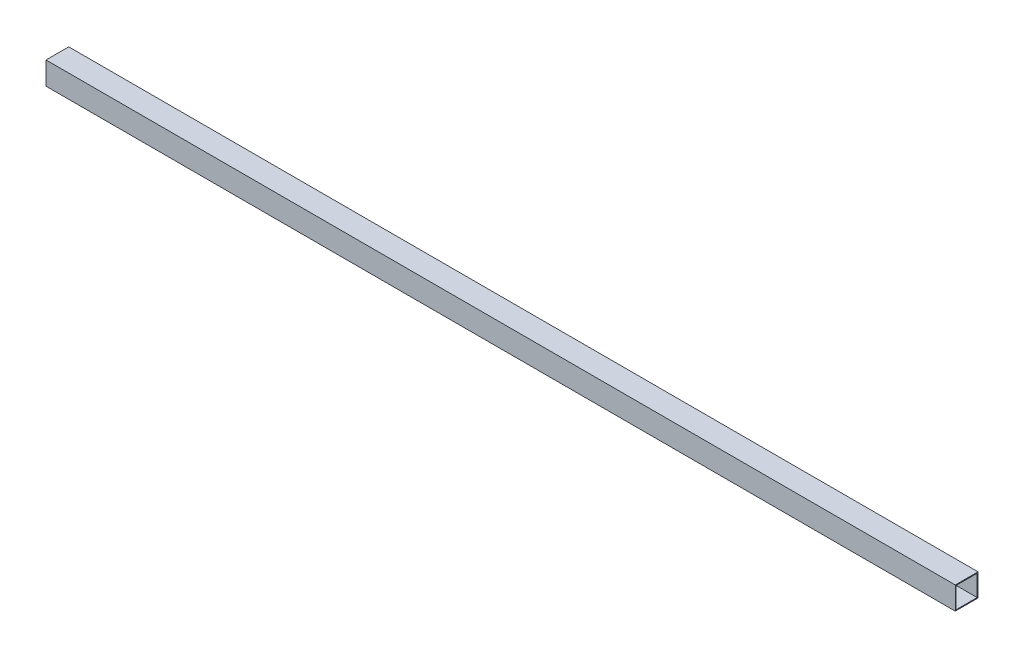
ISO-10303-21;
HEADER;
FILE_DESCRIPTION(('STEP AP214'),'2;1');
FILE_NAME('part.step','',(''),(''),'','','');
FILE_SCHEMA(('AUTOMOTIVE_DESIGN { 1 0 10303 214 1 1 1 1 }'));
ENDSEC;
DATA;
#1=APPLICATION_CONTEXT('core data for automotive mechanical design processes');
#2=APPLICATION_PROTOCOL_DEFINITION('international standard','automotive_design',2000,#1);
#3=PRODUCT_CONTEXT('',#1,'mechanical');
#4=PRODUCT('Part','Part','',(#3));
#5=PRODUCT_RELATED_PRODUCT_CATEGORY('part','',(#4));
#6=PRODUCT_DEFINITION_FORMATION('','',#4);
#7=PRODUCT_DEFINITION_CONTEXT('part definition',#1,'design');
#8=PRODUCT_DEFINITION('design','',#6,#7);
#9=PRODUCT_DEFINITION_SHAPE('','',#8);
#10=(LENGTH_UNIT() NAMED_UNIT(*) SI_UNIT(.MILLI.,.METRE.));
#11=(NAMED_UNIT(*) PLANE_ANGLE_UNIT() SI_UNIT($,.RADIAN.));
#12=(NAMED_UNIT(*) SI_UNIT($,.STERADIAN.) SOLID_ANGLE_UNIT());
#13=UNCERTAINTY_MEASURE_WITH_UNIT(LENGTH_MEASURE(1.E-05),#10,'distance_accuracy_value','');
#14=(GEOMETRIC_REPRESENTATION_CONTEXT(3) GLOBAL_UNCERTAINTY_ASSIGNED_CONTEXT((#13)) GLOBAL_UNIT_ASSIGNED_CONTEXT((#10,
#11,#12)) REPRESENTATION_CONTEXT('',''));
#15=CARTESIAN_POINT('',(0.,0.,0.));
#16=DIRECTION('',(0.,0.,1.));
#17=DIRECTION('',(1.,0.,0.));
#18=AXIS2_PLACEMENT_3D('',#15,#16,#17);
#19=CARTESIAN_POINT('',(1600.,-20.,-20.));
#20=DIRECTION('',(0.,0.,1.));
#21=DIRECTION('',(1.,0.,0.));
#22=AXIS2_PLACEMENT_3D('',#19,#20,#21);
#23=PLANE('',#22);
#24=DIRECTION('',(0.,1.,0.));
#25=VECTOR('',#24,1.);
#26=CARTESIAN_POINT('',(0.,-20.,-20.));
#27=LINE('',#26,#25);
#28=CARTESIAN_POINT('',(0.,-20.,-20.));
#29=VERTEX_POINT('',#28);
#30=CARTESIAN_POINT('',(0.,20.,-20.));
#31=VERTEX_POINT('',#30);
#32=EDGE_CURVE('E147',#29,#31,#27,.T.);
#33=ORIENTED_EDGE('',*,*,#32,.T.);
#34=DIRECTION('',(-1.,0.,0.));
#35=VECTOR('',#34,1.);
#36=CARTESIAN_POINT('',(1600.,20.,-20.));
#37=LINE('',#36,#35);
#38=CARTESIAN_POINT('',(1600.,20.,-20.));
#39=VERTEX_POINT('',#38);
#40=EDGE_CURVE('E11',#39,#31,#37,.T.);
#41=ORIENTED_EDGE('',*,*,#40,.F.);
#42=DIRECTION('',(0.,1.,0.));
#43=VECTOR('',#42,1.);
#44=CARTESIAN_POINT('',(1600.,-20.,-20.));
#45=LINE('',#44,#43);
#46=CARTESIAN_POINT('',(1600.,-20.,-20.));
#47=VERTEX_POINT('',#46);
#48=EDGE_CURVE('E153',#47,#39,#45,.T.);
#49=ORIENTED_EDGE('',*,*,#48,.F.);
#50=DIRECTION('',(-1.,0.,0.));
#51=VECTOR('',#50,1.);
#52=CARTESIAN_POINT('',(1600.,-20.,-20.));
#53=LINE('',#52,#51);
#54=EDGE_CURVE('E167',#47,#29,#53,.T.);
#55=ORIENTED_EDGE('',*,*,#54,.T.);
#56=EDGE_LOOP('',(#33,#41,#49,#55));
#57=FACE_BOUND('',#56,.T.);
#58=ADVANCED_FACE('F39',(#57),#23,.F.);
#59=CARTESIAN_POINT('',(1600.,20.,20.));
#60=DIRECTION('',(0.,-1.,0.));
#61=DIRECTION('',(0.,0.,-1.));
#62=AXIS2_PLACEMENT_3D('',#59,#60,#61);
#63=PLANE('',#62);
#64=DIRECTION('',(0.,0.,1.));
#65=VECTOR('',#64,1.);
#66=CARTESIAN_POINT('',(0.,20.,20.));
#67=LINE('',#66,#65);
#68=CARTESIAN_POINT('',(0.,20.,20.));
#69=VERTEX_POINT('',#68);
#70=EDGE_CURVE('E171',#31,#69,#67,.T.);
#71=ORIENTED_EDGE('',*,*,#70,.T.);
#72=DIRECTION('',(-1.,0.,0.));
#73=VECTOR('',#72,1.);
#74=CARTESIAN_POINT('',(1600.,20.,20.));
#75=LINE('',#74,#73);
#76=CARTESIAN_POINT('',(1600.,20.,20.));
#77=VERTEX_POINT('',#76);
#78=EDGE_CURVE('E47',#77,#69,#75,.T.);
#79=ORIENTED_EDGE('',*,*,#78,.F.);
#80=DIRECTION('',(0.,0.,1.));
#81=VECTOR('',#80,1.);
#82=CARTESIAN_POINT('',(1600.,20.,20.));
#83=LINE('',#82,#81);
#84=EDGE_CURVE('E157',#39,#77,#83,.T.);
#85=ORIENTED_EDGE('',*,*,#84,.F.);
#86=ORIENTED_EDGE('',*,*,#40,.T.);
#87=EDGE_LOOP('',(#71,#79,#85,#86));
#88=FACE_BOUND('',#87,.T.);
#89=ADVANCED_FACE('F205',(#88),#63,.F.);
#90=CARTESIAN_POINT('',(1600.,-20.,20.));
#91=DIRECTION('',(0.,0.,-1.));
#92=DIRECTION('',(-1.,0.,0.));
#93=AXIS2_PLACEMENT_3D('',#90,#91,#92);
#94=PLANE('',#93);
#95=DIRECTION('',(0.,-1.,0.));
#96=VECTOR('',#95,1.);
#97=CARTESIAN_POINT('',(0.,-20.,20.));
#98=LINE('',#97,#96);
#99=CARTESIAN_POINT('',(0.,-20.,20.));
#100=VERTEX_POINT('',#99);
#101=EDGE_CURVE('E174',#69,#100,#98,.T.);
#102=ORIENTED_EDGE('',*,*,#101,.T.);
#103=DIRECTION('',(-1.,0.,0.));
#104=VECTOR('',#103,1.);
#105=CARTESIAN_POINT('',(1600.,-20.,20.));
#106=LINE('',#105,#104);
#107=CARTESIAN_POINT('',(1600.,-20.,20.));
#108=VERTEX_POINT('',#107);
#109=EDGE_CURVE('E182',#108,#100,#106,.T.);
#110=ORIENTED_EDGE('',*,*,#109,.F.);
#111=DIRECTION('',(0.,-1.,0.));
#112=VECTOR('',#111,1.);
#113=CARTESIAN_POINT('',(1600.,-20.,20.));
#114=LINE('',#113,#112);
#115=EDGE_CURVE('E161',#77,#108,#114,.T.);
#116=ORIENTED_EDGE('',*,*,#115,.F.);
#117=ORIENTED_EDGE('',*,*,#78,.T.);
#118=EDGE_LOOP('',(#102,#110,#116,#117));
#119=FACE_BOUND('',#118,.T.);
#120=ADVANCED_FACE('F191',(#119),#94,.F.);
#121=CARTESIAN_POINT('',(1600.,-20.,20.));
#122=DIRECTION('',(0.,1.,0.));
#123=DIRECTION('',(0.,0.,1.));
#124=AXIS2_PLACEMENT_3D('',#121,#122,#123);
#125=PLANE('',#124);
#126=DIRECTION('',(0.,0.,-1.));
#127=VECTOR('',#126,1.);
#128=CARTESIAN_POINT('',(0.,-20.,20.));
#129=LINE('',#128,#127);
#130=EDGE_CURVE('E158',#100,#29,#129,.T.);
#131=ORIENTED_EDGE('',*,*,#130,.T.);
#132=ORIENTED_EDGE('',*,*,#54,.F.);
#133=DIRECTION('',(0.,0.,-1.));
#134=VECTOR('',#133,1.);
#135=CARTESIAN_POINT('',(1600.,-20.,20.));
#136=LINE('',#135,#134);
#137=EDGE_CURVE('E164',#108,#47,#136,.T.);
#138=ORIENTED_EDGE('',*,*,#137,.F.);
#139=ORIENTED_EDGE('',*,*,#109,.T.);
#140=EDGE_LOOP('',(#131,#132,#138,#139));
#141=FACE_BOUND('',#140,.T.);
#142=ADVANCED_FACE('F200',(#141),#125,.F.);
#143=CARTESIAN_POINT('',(1600.,0.,0.));
#144=DIRECTION('',(-1.,0.,0.));
#145=DIRECTION('',(0.,0.,1.));
#146=AXIS2_PLACEMENT_3D('',#143,#144,#145);
#147=PLANE('',#146);
#148=DIRECTION('',(0.,0.,1.));
#149=VECTOR('',#148,1.);
#150=CARTESIAN_POINT('',(1600.,-18.5,-18.5));
#151=LINE('',#150,#149);
#152=CARTESIAN_POINT('',(1600.,-18.5,-18.5));
#153=VERTEX_POINT('',#152);
#154=CARTESIAN_POINT('',(1600.,-18.5,18.5));
#155=VERTEX_POINT('',#154);
#156=EDGE_CURVE('E113',#153,#155,#151,.T.);
#157=ORIENTED_EDGE('',*,*,#156,.T.);
#158=DIRECTION('',(0.,1.,0.));
#159=VECTOR('',#158,1.);
#160=CARTESIAN_POINT('',(1600.,-18.5,18.5));
#161=LINE('',#160,#159);
#162=CARTESIAN_POINT('',(1600.,18.5,18.5));
#163=VERTEX_POINT('',#162);
#164=EDGE_CURVE('E106',#155,#163,#161,.T.);
#165=ORIENTED_EDGE('',*,*,#164,.T.);
#166=DIRECTION('',(0.,0.,-1.));
#167=VECTOR('',#166,1.);
#168=CARTESIAN_POINT('',(1600.,18.5,-18.5));
#169=LINE('',#168,#167);
#170=CARTESIAN_POINT('',(1600.,18.5,-18.5));
#171=VERTEX_POINT('',#170);
#172=EDGE_CURVE('E116',#163,#171,#169,.T.);
#173=ORIENTED_EDGE('',*,*,#172,.T.);
#174=DIRECTION('',(0.,-1.,0.));
#175=VECTOR('',#174,1.);
#176=CARTESIAN_POINT('',(1600.,-18.5,-18.5));
#177=LINE('',#176,#175);
#178=EDGE_CURVE('E54',#171,#153,#177,.T.);
#179=ORIENTED_EDGE('',*,*,#178,.T.);
#180=EDGE_LOOP('',(#157,#165,#173,#179));
#181=FACE_BOUND('',#180,.T.);
#182=ORIENTED_EDGE('',*,*,#48,.T.);
#183=ORIENTED_EDGE('',*,*,#84,.T.);
#184=ORIENTED_EDGE('',*,*,#115,.T.);
#185=ORIENTED_EDGE('',*,*,#137,.T.);
#186=EDGE_LOOP('',(#182,#183,#184,#185));
#187=FACE_BOUND('',#186,.T.);
#188=ADVANCED_FACE('F121',(#181,#187),#147,.F.);
#189=CARTESIAN_POINT('',(0.,0.,0.));
#190=DIRECTION('',(-1.,0.,0.));
#191=DIRECTION('',(0.,0.,1.));
#192=AXIS2_PLACEMENT_3D('',#189,#190,#191);
#193=PLANE('',#192);
#194=DIRECTION('',(0.,1.,0.));
#195=VECTOR('',#194,1.);
#196=CARTESIAN_POINT('',(0.,-18.5,18.5));
#197=LINE('',#196,#195);
#198=CARTESIAN_POINT('',(0.,-18.5,18.5));
#199=VERTEX_POINT('',#198);
#200=CARTESIAN_POINT('',(0.,18.5,18.5));
#201=VERTEX_POINT('',#200);
#202=EDGE_CURVE('E62',#199,#201,#197,.T.);
#203=ORIENTED_EDGE('',*,*,#202,.F.);
#204=DIRECTION('',(0.,0.,1.));
#205=VECTOR('',#204,1.);
#206=CARTESIAN_POINT('',(0.,-18.5,-18.5));
#207=LINE('',#206,#205);
#208=CARTESIAN_POINT('',(0.,-18.5,-18.5));
#209=VERTEX_POINT('',#208);
#210=EDGE_CURVE('E125',#209,#199,#207,.T.);
#211=ORIENTED_EDGE('',*,*,#210,.F.);
#212=DIRECTION('',(0.,-1.,0.));
#213=VECTOR('',#212,1.);
#214=CARTESIAN_POINT('',(0.,-18.5,-18.5));
#215=LINE('',#214,#213);
#216=CARTESIAN_POINT('',(0.,18.5,-18.5));
#217=VERTEX_POINT('',#216);
#218=EDGE_CURVE('E129',#217,#209,#215,.T.);
#219=ORIENTED_EDGE('',*,*,#218,.F.);
#220=DIRECTION('',(0.,0.,-1.));
#221=VECTOR('',#220,1.);
#222=CARTESIAN_POINT('',(0.,18.5,-18.5));
#223=LINE('',#222,#221);
#224=EDGE_CURVE('E138',#201,#217,#223,.T.);
#225=ORIENTED_EDGE('',*,*,#224,.F.);
#226=EDGE_LOOP('',(#203,#211,#219,#225));
#227=FACE_BOUND('',#226,.T.);
#228=ORIENTED_EDGE('',*,*,#32,.F.);
#229=ORIENTED_EDGE('',*,*,#130,.F.);
#230=ORIENTED_EDGE('',*,*,#101,.F.);
#231=ORIENTED_EDGE('',*,*,#70,.F.);
#232=EDGE_LOOP('',(#228,#229,#230,#231));
#233=FACE_BOUND('',#232,.T.);
#234=ADVANCED_FACE('F197',(#227,#233),#193,.T.);
#235=CARTESIAN_POINT('',(1600.,-18.5,18.5));
#236=DIRECTION('',(0.,0.,1.));
#237=DIRECTION('',(1.,0.,0.));
#238=AXIS2_PLACEMENT_3D('',#235,#236,#237);
#239=PLANE('',#238);
#240=ORIENTED_EDGE('',*,*,#202,.T.);
#241=DIRECTION('',(-1.,0.,0.));
#242=VECTOR('',#241,1.);
#243=CARTESIAN_POINT('',(1600.,18.5,18.5));
#244=LINE('',#243,#242);
#245=EDGE_CURVE('E102',#163,#201,#244,.T.);
#246=ORIENTED_EDGE('',*,*,#245,.F.);
#247=ORIENTED_EDGE('',*,*,#164,.F.);
#248=DIRECTION('',(-1.,0.,0.));
#249=VECTOR('',#248,1.);
#250=CARTESIAN_POINT('',(1600.,-18.5,18.5));
#251=LINE('',#250,#249);
#252=EDGE_CURVE('E144',#155,#199,#251,.T.);
#253=ORIENTED_EDGE('',*,*,#252,.T.);
#254=EDGE_LOOP('',(#240,#246,#247,#253));
#255=FACE_BOUND('',#254,.T.);
#256=ADVANCED_FACE('F104',(#255),#239,.F.);
#257=CARTESIAN_POINT('',(1600.,-18.5,-18.5));
#258=DIRECTION('',(0.,-1.,0.));
#259=DIRECTION('',(0.,0.,-1.));
#260=AXIS2_PLACEMENT_3D('',#257,#258,#259);
#261=PLANE('',#260);
#262=ORIENTED_EDGE('',*,*,#210,.T.);
#263=ORIENTED_EDGE('',*,*,#252,.F.);
#264=ORIENTED_EDGE('',*,*,#156,.F.);
#265=DIRECTION('',(-1.,0.,0.));
#266=VECTOR('',#265,1.);
#267=CARTESIAN_POINT('',(1600.,-18.5,-18.5));
#268=LINE('',#267,#266);
#269=EDGE_CURVE('E148',#153,#209,#268,.T.);
#270=ORIENTED_EDGE('',*,*,#269,.T.);
#271=EDGE_LOOP('',(#262,#263,#264,#270));
#272=FACE_BOUND('',#271,.T.);
#273=ADVANCED_FACE('F222',(#272),#261,.F.);
#274=CARTESIAN_POINT('',(1600.,-18.5,-18.5));
#275=DIRECTION('',(0.,0.,-1.));
#276=DIRECTION('',(-1.,0.,0.));
#277=AXIS2_PLACEMENT_3D('',#274,#275,#276);
#278=PLANE('',#277);
#279=ORIENTED_EDGE('',*,*,#218,.T.);
#280=ORIENTED_EDGE('',*,*,#269,.F.);
#281=ORIENTED_EDGE('',*,*,#178,.F.);
#282=DIRECTION('',(-1.,0.,0.));
#283=VECTOR('',#282,1.);
#284=CARTESIAN_POINT('',(1600.,18.5,-18.5));
#285=LINE('',#284,#283);
#286=EDGE_CURVE('E112',#171,#217,#285,.T.);
#287=ORIENTED_EDGE('',*,*,#286,.T.);
#288=EDGE_LOOP('',(#279,#280,#281,#287));
#289=FACE_BOUND('',#288,.T.);
#290=ADVANCED_FACE('F225',(#289),#278,.F.);
#291=CARTESIAN_POINT('',(1600.,18.5,-18.5));
#292=DIRECTION('',(0.,1.,0.));
#293=DIRECTION('',(0.,0.,1.));
#294=AXIS2_PLACEMENT_3D('',#291,#292,#293);
#295=PLANE('',#294);
#296=ORIENTED_EDGE('',*,*,#224,.T.);
#297=ORIENTED_EDGE('',*,*,#286,.F.);
#298=ORIENTED_EDGE('',*,*,#172,.F.);
#299=ORIENTED_EDGE('',*,*,#245,.T.);
#300=EDGE_LOOP('',(#296,#297,#298,#299));
#301=FACE_BOUND('',#300,.T.);
#302=ADVANCED_FACE('F117',(#301),#295,.F.);
#303=CLOSED_SHELL('',(#58,#89,#120,#142,#188,#234,#256,#273,#290,#302));
#304=MANIFOLD_SOLID_BREP('B2',#303);
#305=ADVANCED_BREP_SHAPE_REPRESENTATION('',(#18,#304),#14);
#306=SHAPE_DEFINITION_REPRESENTATION(#9,#305);
ENDSEC;
END-ISO-10303-21;
